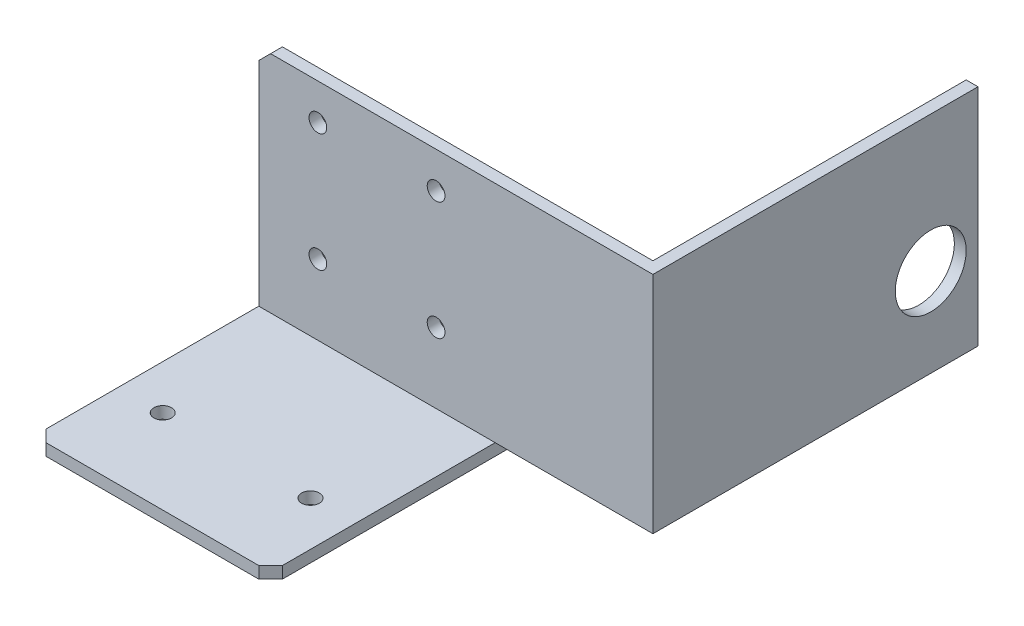
ISO-10303-21;
HEADER;
FILE_DESCRIPTION(('STEP AP214'),'2;1');
FILE_NAME('part.step','',(''),(''),'','','');
FILE_SCHEMA(('AUTOMOTIVE_DESIGN { 1 0 10303 214 1 1 1 1 }'));
ENDSEC;
DATA;
#1=APPLICATION_CONTEXT('core data for automotive mechanical design processes');
#2=APPLICATION_PROTOCOL_DEFINITION('international standard','automotive_design',2000,#1);
#3=PRODUCT_CONTEXT('',#1,'mechanical');
#4=PRODUCT('Part','Part','',(#3));
#5=PRODUCT_RELATED_PRODUCT_CATEGORY('part','',(#4));
#6=PRODUCT_DEFINITION_FORMATION('','',#4);
#7=PRODUCT_DEFINITION_CONTEXT('part definition',#1,'design');
#8=PRODUCT_DEFINITION('design','',#6,#7);
#9=PRODUCT_DEFINITION_SHAPE('','',#8);
#10=(LENGTH_UNIT() NAMED_UNIT(*) SI_UNIT(.MILLI.,.METRE.));
#11=(NAMED_UNIT(*) PLANE_ANGLE_UNIT() SI_UNIT($,.RADIAN.));
#12=(NAMED_UNIT(*) SI_UNIT($,.STERADIAN.) SOLID_ANGLE_UNIT());
#13=UNCERTAINTY_MEASURE_WITH_UNIT(LENGTH_MEASURE(1.E-05),#10,'distance_accuracy_value','');
#14=(GEOMETRIC_REPRESENTATION_CONTEXT(3) GLOBAL_UNCERTAINTY_ASSIGNED_CONTEXT((#13)) GLOBAL_UNIT_ASSIGNED_CONTEXT((#10,
#11,#12)) REPRESENTATION_CONTEXT('',''));
#15=CARTESIAN_POINT('',(0.,0.,0.));
#16=DIRECTION('',(0.,0.,1.));
#17=DIRECTION('',(1.,0.,0.));
#18=AXIS2_PLACEMENT_3D('',#15,#16,#17);
#19=CARTESIAN_POINT('',(40.,0.,38.));
#20=DIRECTION('',(0.,-1.,0.));
#21=DIRECTION('',(0.,0.,-1.));
#22=AXIS2_PLACEMENT_3D('',#19,#20,#21);
#23=PLANE('',#22);
#24=CARTESIAN_POINT('',(7.5,0.,23.75));
#25=DIRECTION('',(0.,-1.,0.));
#26=DIRECTION('',(0.,0.,-1.));
#27=AXIS2_PLACEMENT_3D('',#24,#25,#26);
#28=CIRCLE('',#27,1.49999999997635);
#29=CARTESIAN_POINT('',(7.5,0.,22.2500000000236));
#30=VERTEX_POINT('',#29);
#31=EDGE_CURVE('E198',#30,#30,#28,.F.);
#32=ORIENTED_EDGE('',*,*,#31,.F.);
#33=EDGE_LOOP('',(#32));
#34=FACE_BOUND('',#33,.T.);
#35=CARTESIAN_POINT('',(32.5,0.,23.75));
#36=DIRECTION('',(0.,-1.,0.));
#37=DIRECTION('',(0.,0.,-1.));
#38=AXIS2_PLACEMENT_3D('',#35,#36,#37);
#39=CIRCLE('',#38,1.49999999997635);
#40=CARTESIAN_POINT('',(32.5,0.,22.2500000000236));
#41=VERTEX_POINT('',#40);
#42=EDGE_CURVE('E204',#41,#41,#39,.F.);
#43=ORIENTED_EDGE('',*,*,#42,.F.);
#44=EDGE_LOOP('',(#43));
#45=FACE_BOUND('',#44,.T.);
#46=DIRECTION('',(-1.,0.,0.));
#47=VECTOR('',#46,1.);
#48=CARTESIAN_POINT('',(40.,0.,38.));
#49=LINE('',#48,#47);
#50=CARTESIAN_POINT('',(38.,0.,38.));
#51=VERTEX_POINT('',#50);
#52=CARTESIAN_POINT('',(2.00000000000001,0.,38.));
#53=VERTEX_POINT('',#52);
#54=EDGE_CURVE('E237',#51,#53,#49,.T.);
#55=ORIENTED_EDGE('',*,*,#54,.F.);
#56=DIRECTION('',(0.70710678118655,0.,-0.707106781186545));
#57=VECTOR('',#56,1.);
#58=CARTESIAN_POINT('',(40.,0.,36.));
#59=LINE('',#58,#57);
#60=CARTESIAN_POINT('',(40.,0.,36.));
#61=VERTEX_POINT('',#60);
#62=EDGE_CURVE('E254',#51,#61,#59,.T.);
#63=ORIENTED_EDGE('',*,*,#62,.T.);
#64=DIRECTION('',(0.,0.,1.));
#65=VECTOR('',#64,1.);
#66=CARTESIAN_POINT('',(40.,0.,38.));
#67=LINE('',#66,#65);
#68=CARTESIAN_POINT('',(40.,0.,0.));
#69=VERTEX_POINT('',#68);
#70=EDGE_CURVE('E208',#69,#61,#67,.T.);
#71=ORIENTED_EDGE('',*,*,#70,.F.);
#72=DIRECTION('',(-1.,0.,0.));
#73=VECTOR('',#72,1.);
#74=CARTESIAN_POINT('',(40.,0.,0.));
#75=LINE('',#74,#73);
#76=CARTESIAN_POINT('',(0.,0.,0.));
#77=VERTEX_POINT('',#76);
#78=EDGE_CURVE('E217',#69,#77,#75,.T.);
#79=ORIENTED_EDGE('',*,*,#78,.T.);
#80=DIRECTION('',(0.,0.,1.));
#81=VECTOR('',#80,1.);
#82=CARTESIAN_POINT('',(0.,0.,38.));
#83=LINE('',#82,#81);
#84=CARTESIAN_POINT('',(0.,0.,36.));
#85=VERTEX_POINT('',#84);
#86=EDGE_CURVE('E207',#77,#85,#83,.T.);
#87=ORIENTED_EDGE('',*,*,#86,.T.);
#88=DIRECTION('',(-0.707106781186545,0.,-0.70710678118655));
#89=VECTOR('',#88,1.);
#90=CARTESIAN_POINT('',(1.99999999999999,0.,38.));
#91=LINE('',#90,#89);
#92=EDGE_CURVE('E252',#85,#53,#91,.F.);
#93=ORIENTED_EDGE('',*,*,#92,.T.);
#94=EDGE_LOOP('',(#55,#63,#71,#79,#87,#93));
#95=FACE_BOUND('',#94,.T.);
#96=ADVANCED_FACE('F38',(#34,#45,#95),#23,.F.);
#97=CARTESIAN_POINT('',(40.,-2.,38.));
#98=DIRECTION('',(0.,0.,-1.));
#99=DIRECTION('',(-1.,0.,0.));
#100=AXIS2_PLACEMENT_3D('',#97,#98,#99);
#101=PLANE('',#100);
#102=DIRECTION('',(-1.,0.,0.));
#103=VECTOR('',#102,1.);
#104=CARTESIAN_POINT('',(40.,-2.,38.));
#105=LINE('',#104,#103);
#106=CARTESIAN_POINT('',(38.,-2.,38.));
#107=VERTEX_POINT('',#106);
#108=CARTESIAN_POINT('',(2.00000000000001,-2.,38.));
#109=VERTEX_POINT('',#108);
#110=EDGE_CURVE('E234',#107,#109,#105,.T.);
#111=ORIENTED_EDGE('',*,*,#110,.F.);
#112=DIRECTION('',(0.,1.,0.));
#113=VECTOR('',#112,1.);
#114=CARTESIAN_POINT('',(38.,0.,38.));
#115=LINE('',#114,#113);
#116=EDGE_CURVE('E250',#107,#51,#115,.T.);
#117=ORIENTED_EDGE('',*,*,#116,.T.);
#118=ORIENTED_EDGE('',*,*,#54,.T.);
#119=DIRECTION('',(0.,-1.,0.));
#120=VECTOR('',#119,1.);
#121=CARTESIAN_POINT('',(1.99999999999999,-2.,38.));
#122=LINE('',#121,#120);
#123=EDGE_CURVE('E247',#53,#109,#122,.T.);
#124=ORIENTED_EDGE('',*,*,#123,.T.);
#125=EDGE_LOOP('',(#111,#117,#118,#124));
#126=FACE_BOUND('',#125,.T.);
#127=ADVANCED_FACE('F304',(#126),#101,.F.);
#128=CARTESIAN_POINT('',(40.,-2.,-2.00000000000001));
#129=DIRECTION('',(0.,1.,0.));
#130=DIRECTION('',(0.,0.,1.));
#131=AXIS2_PLACEMENT_3D('',#128,#129,#130);
#132=PLANE('',#131);
#133=CARTESIAN_POINT('',(7.5,-2.,23.75));
#134=DIRECTION('',(0.,-1.,0.));
#135=DIRECTION('',(0.,0.,-1.));
#136=AXIS2_PLACEMENT_3D('',#133,#134,#135);
#137=CIRCLE('',#136,1.49999999997635);
#138=CARTESIAN_POINT('',(7.5,-2.,22.2500000000236));
#139=VERTEX_POINT('',#138);
#140=EDGE_CURVE('E195',#139,#139,#137,.T.);
#141=ORIENTED_EDGE('',*,*,#140,.F.);
#142=EDGE_LOOP('',(#141));
#143=FACE_BOUND('',#142,.T.);
#144=CARTESIAN_POINT('',(32.5,-2.,23.75));
#145=DIRECTION('',(0.,-1.,0.));
#146=DIRECTION('',(0.,0.,-1.));
#147=AXIS2_PLACEMENT_3D('',#144,#145,#146);
#148=CIRCLE('',#147,1.49999999997635);
#149=CARTESIAN_POINT('',(32.5,-2.,22.2500000000236));
#150=VERTEX_POINT('',#149);
#151=EDGE_CURVE('E201',#150,#150,#148,.T.);
#152=ORIENTED_EDGE('',*,*,#151,.F.);
#153=EDGE_LOOP('',(#152));
#154=FACE_BOUND('',#153,.T.);
#155=DIRECTION('',(0.,0.,-1.));
#156=VECTOR('',#155,1.);
#157=CARTESIAN_POINT('',(40.,-2.,-2.00000000000001));
#158=LINE('',#157,#156);
#159=CARTESIAN_POINT('',(40.,-2.,36.));
#160=VERTEX_POINT('',#159);
#161=CARTESIAN_POINT('',(40.,-2.,-2.00000000000001));
#162=VERTEX_POINT('',#161);
#163=EDGE_CURVE('E211',#160,#162,#158,.T.);
#164=ORIENTED_EDGE('',*,*,#163,.F.);
#165=DIRECTION('',(-0.70710678118655,0.,0.707106781186545));
#166=VECTOR('',#165,1.);
#167=CARTESIAN_POINT('',(40.,-2.,36.));
#168=LINE('',#167,#166);
#169=EDGE_CURVE('E245',#160,#107,#168,.T.);
#170=ORIENTED_EDGE('',*,*,#169,.T.);
#171=ORIENTED_EDGE('',*,*,#110,.T.);
#172=DIRECTION('',(0.707106781186545,0.,0.70710678118655));
#173=VECTOR('',#172,1.);
#174=CARTESIAN_POINT('',(1.99999999999999,-2.,38.));
#175=LINE('',#174,#173);
#176=CARTESIAN_POINT('',(0.,-2.,36.));
#177=VERTEX_POINT('',#176);
#178=EDGE_CURVE('E243',#109,#177,#175,.F.);
#179=ORIENTED_EDGE('',*,*,#178,.T.);
#180=DIRECTION('',(0.,0.,-1.));
#181=VECTOR('',#180,1.);
#182=CARTESIAN_POINT('',(0.,-2.,-2.00000000000001));
#183=LINE('',#182,#181);
#184=CARTESIAN_POINT('',(0.,-2.,-2.00000000000001));
#185=VERTEX_POINT('',#184);
#186=EDGE_CURVE('E220',#177,#185,#183,.T.);
#187=ORIENTED_EDGE('',*,*,#186,.T.);
#188=DIRECTION('',(-1.,0.,0.));
#189=VECTOR('',#188,1.);
#190=CARTESIAN_POINT('',(40.,-2.,-2.00000000000001));
#191=LINE('',#190,#189);
#192=EDGE_CURVE('E231',#162,#185,#191,.T.);
#193=ORIENTED_EDGE('',*,*,#192,.F.);
#194=EDGE_LOOP('',(#164,#170,#171,#179,#187,#193));
#195=FACE_BOUND('',#194,.T.);
#196=ADVANCED_FACE('F306',(#143,#154,#195),#132,.F.);
#197=CARTESIAN_POINT('',(40.,38.,-2.));
#198=DIRECTION('',(0.,0.,1.));
#199=DIRECTION('',(0.,-1.,0.));
#200=AXIS2_PLACEMENT_3D('',#197,#198,#199);
#201=PLANE('',#200);
#202=DIRECTION('',(-1.,0.,0.));
#203=VECTOR('',#202,1.);
#204=CARTESIAN_POINT('',(40.,38.,-2.));
#205=LINE('',#204,#203);
#206=CARTESIAN_POINT('',(64.69,38.,-2.00000000000001));
#207=VERTEX_POINT('',#206);
#208=CARTESIAN_POINT('',(2.00000000000001,38.,-2.));
#209=VERTEX_POINT('',#208);
#210=EDGE_CURVE('E62',#207,#209,#205,.T.);
#211=ORIENTED_EDGE('',*,*,#210,.F.);
#212=DIRECTION('',(0.,-1.,0.));
#213=VECTOR('',#212,1.);
#214=CARTESIAN_POINT('',(64.69,38.,-2.00000000000001));
#215=LINE('',#214,#213);
#216=CARTESIAN_POINT('',(64.69,0.,-2.00000000000001));
#217=VERTEX_POINT('',#216);
#218=EDGE_CURVE('E152',#207,#217,#215,.T.);
#219=ORIENTED_EDGE('',*,*,#218,.T.);
#220=DIRECTION('',(1.,0.,0.));
#221=VECTOR('',#220,1.);
#222=CARTESIAN_POINT('',(37.,0.,-2.00000000000001));
#223=LINE('',#222,#221);
#224=CARTESIAN_POINT('',(40.,0.,-2.00000000000001));
#225=VERTEX_POINT('',#224);
#226=EDGE_CURVE('E151',#225,#217,#223,.T.);
#227=ORIENTED_EDGE('',*,*,#226,.F.);
#228=DIRECTION('',(0.,1.,0.));
#229=VECTOR('',#228,1.);
#230=CARTESIAN_POINT('',(40.,38.,-2.));
#231=LINE('',#230,#229);
#232=EDGE_CURVE('E214',#162,#225,#231,.T.);
#233=ORIENTED_EDGE('',*,*,#232,.F.);
#234=ORIENTED_EDGE('',*,*,#192,.T.);
#235=DIRECTION('',(0.,1.,0.));
#236=VECTOR('',#235,1.);
#237=CARTESIAN_POINT('',(0.,38.,-2.));
#238=LINE('',#237,#236);
#239=CARTESIAN_POINT('',(0.,36.,-2.));
#240=VERTEX_POINT('',#239);
#241=EDGE_CURVE('E222',#185,#240,#238,.T.);
#242=ORIENTED_EDGE('',*,*,#241,.T.);
#243=DIRECTION('',(-0.707106781186545,-0.70710678118655,0.));
#244=VECTOR('',#243,1.);
#245=CARTESIAN_POINT('',(1.99999999999999,38.,-2.));
#246=LINE('',#245,#244);
#247=EDGE_CURVE('E47',#240,#209,#246,.F.);
#248=ORIENTED_EDGE('',*,*,#247,.T.);
#249=EDGE_LOOP('',(#211,#219,#227,#233,#234,#242,#248));
#250=FACE_BOUND('',#249,.T.);
#251=CARTESIAN_POINT('',(9.99999999999981,11.9,-2.));
#252=DIRECTION('',(0.,0.,-1.));
#253=DIRECTION('',(0.,1.,0.));
#254=AXIS2_PLACEMENT_3D('',#251,#252,#253);
#255=CIRCLE('',#254,1.5);
#256=CARTESIAN_POINT('',(9.99999999999981,13.4,-2.));
#257=VERTEX_POINT('',#256);
#258=EDGE_CURVE('E170',#257,#257,#255,.T.);
#259=ORIENTED_EDGE('',*,*,#258,.F.);
#260=EDGE_LOOP('',(#259));
#261=FACE_BOUND('',#260,.T.);
#262=CARTESIAN_POINT('',(29.9999999999998,11.8999999999999,-2.));
#263=DIRECTION('',(0.,0.,-1.));
#264=DIRECTION('',(0.,1.,0.));
#265=AXIS2_PLACEMENT_3D('',#262,#263,#264);
#266=CIRCLE('',#265,1.5);
#267=CARTESIAN_POINT('',(29.9999999999998,13.3999999999999,-2.));
#268=VERTEX_POINT('',#267);
#269=EDGE_CURVE('E177',#268,#268,#266,.T.);
#270=ORIENTED_EDGE('',*,*,#269,.F.);
#271=EDGE_LOOP('',(#270));
#272=FACE_BOUND('',#271,.T.);
#273=CARTESIAN_POINT('',(30.,31.8999999999999,-2.));
#274=DIRECTION('',(0.,0.,-1.));
#275=DIRECTION('',(0.,1.,0.));
#276=AXIS2_PLACEMENT_3D('',#273,#274,#275);
#277=CIRCLE('',#276,1.5);
#278=CARTESIAN_POINT('',(30.,33.3999999999999,-2.));
#279=VERTEX_POINT('',#278);
#280=EDGE_CURVE('E183',#279,#279,#277,.T.);
#281=ORIENTED_EDGE('',*,*,#280,.F.);
#282=EDGE_LOOP('',(#281));
#283=FACE_BOUND('',#282,.T.);
#284=CARTESIAN_POINT('',(10.,31.9,-2.));
#285=DIRECTION('',(0.,0.,-1.));
#286=DIRECTION('',(0.,1.,0.));
#287=AXIS2_PLACEMENT_3D('',#284,#285,#286);
#288=CIRCLE('',#287,1.5);
#289=CARTESIAN_POINT('',(10.,33.4,-2.));
#290=VERTEX_POINT('',#289);
#291=EDGE_CURVE('E189',#290,#290,#288,.T.);
#292=ORIENTED_EDGE('',*,*,#291,.F.);
#293=EDGE_LOOP('',(#292));
#294=FACE_BOUND('',#293,.T.);
#295=ADVANCED_FACE('F267',(#250,#261,#272,#283,#294),#201,.F.);
#296=CARTESIAN_POINT('',(40.,38.,0.));
#297=DIRECTION('',(0.,-1.,0.));
#298=DIRECTION('',(0.,0.,-1.));
#299=AXIS2_PLACEMENT_3D('',#296,#297,#298);
#300=PLANE('',#299);
#301=DIRECTION('',(0.,0.,1.));
#302=VECTOR('',#301,1.);
#303=CARTESIAN_POINT('',(66.69,38.,0.));
#304=LINE('',#303,#302);
#305=CARTESIAN_POINT('',(66.69,38.,-55.));
#306=VERTEX_POINT('',#305);
#307=CARTESIAN_POINT('',(66.69,38.,0.));
#308=VERTEX_POINT('',#307);
#309=EDGE_CURVE('E165',#306,#308,#304,.T.);
#310=ORIENTED_EDGE('',*,*,#309,.F.);
#311=DIRECTION('',(1.,0.,0.));
#312=VECTOR('',#311,1.);
#313=CARTESIAN_POINT('',(64.69,38.,-55.));
#314=LINE('',#313,#312);
#315=CARTESIAN_POINT('',(64.69,38.,-55.));
#316=VERTEX_POINT('',#315);
#317=EDGE_CURVE('E143',#316,#306,#314,.T.);
#318=ORIENTED_EDGE('',*,*,#317,.F.);
#319=DIRECTION('',(0.,0.,1.));
#320=VECTOR('',#319,1.);
#321=CARTESIAN_POINT('',(64.69,38.,-2.00000000000001));
#322=LINE('',#321,#320);
#323=EDGE_CURVE('E144',#316,#207,#322,.T.);
#324=ORIENTED_EDGE('',*,*,#323,.T.);
#325=ORIENTED_EDGE('',*,*,#210,.T.);
#326=DIRECTION('',(0.,0.,1.));
#327=VECTOR('',#326,1.);
#328=CARTESIAN_POINT('',(1.99999999999999,38.,0.));
#329=LINE('',#328,#327);
#330=CARTESIAN_POINT('',(2.00000000000001,38.,0.));
#331=VERTEX_POINT('',#330);
#332=EDGE_CURVE('E260',#209,#331,#329,.T.);
#333=ORIENTED_EDGE('',*,*,#332,.T.);
#334=DIRECTION('',(-1.,0.,0.));
#335=VECTOR('',#334,1.);
#336=CARTESIAN_POINT('',(40.,38.,0.));
#337=LINE('',#336,#335);
#338=EDGE_CURVE('E228',#308,#331,#337,.T.);
#339=ORIENTED_EDGE('',*,*,#338,.F.);
#340=EDGE_LOOP('',(#310,#318,#324,#325,#333,#339));
#341=FACE_BOUND('',#340,.T.);
#342=ADVANCED_FACE('F273',(#341),#300,.F.);
#343=CARTESIAN_POINT('',(40.,0.,0.));
#344=DIRECTION('',(0.,0.,-1.));
#345=DIRECTION('',(-1.,0.,0.));
#346=AXIS2_PLACEMENT_3D('',#343,#344,#345);
#347=PLANE('',#346);
#348=ORIENTED_EDGE('',*,*,#78,.F.);
#349=DIRECTION('',(1.,0.,0.));
#350=VECTOR('',#349,1.);
#351=CARTESIAN_POINT('',(37.,0.,0.));
#352=LINE('',#351,#350);
#353=CARTESIAN_POINT('',(66.69,0.,0.));
#354=VERTEX_POINT('',#353);
#355=EDGE_CURVE('E168',#69,#354,#352,.T.);
#356=ORIENTED_EDGE('',*,*,#355,.T.);
#357=DIRECTION('',(0.,-1.,0.));
#358=VECTOR('',#357,1.);
#359=CARTESIAN_POINT('',(66.69,38.,0.));
#360=LINE('',#359,#358);
#361=EDGE_CURVE('E159',#308,#354,#360,.T.);
#362=ORIENTED_EDGE('',*,*,#361,.F.);
#363=ORIENTED_EDGE('',*,*,#338,.T.);
#364=DIRECTION('',(0.707106781186545,0.70710678118655,0.));
#365=VECTOR('',#364,1.);
#366=CARTESIAN_POINT('',(1.99999999999999,38.,0.));
#367=LINE('',#366,#365);
#368=CARTESIAN_POINT('',(0.,36.,0.));
#369=VERTEX_POINT('',#368);
#370=EDGE_CURVE('E262',#331,#369,#367,.F.);
#371=ORIENTED_EDGE('',*,*,#370,.T.);
#372=DIRECTION('',(0.,-1.,0.));
#373=VECTOR('',#372,1.);
#374=CARTESIAN_POINT('',(0.,0.,0.));
#375=LINE('',#374,#373);
#376=EDGE_CURVE('E212',#369,#77,#375,.T.);
#377=ORIENTED_EDGE('',*,*,#376,.T.);
#378=EDGE_LOOP('',(#348,#356,#362,#363,#371,#377));
#379=FACE_BOUND('',#378,.T.);
#380=CARTESIAN_POINT('',(10.,31.9,0.));
#381=DIRECTION('',(0.,0.,-1.));
#382=DIRECTION('',(-1.,0.,0.));
#383=AXIS2_PLACEMENT_3D('',#380,#381,#382);
#384=CIRCLE('',#383,1.5);
#385=CARTESIAN_POINT('',(8.50000000000001,31.9,0.));
#386=VERTEX_POINT('',#385);
#387=EDGE_CURVE('E192',#386,#386,#384,.F.);
#388=ORIENTED_EDGE('',*,*,#387,.F.);
#389=EDGE_LOOP('',(#388));
#390=FACE_BOUND('',#389,.T.);
#391=CARTESIAN_POINT('',(30.,31.8999999999999,0.));
#392=DIRECTION('',(0.,0.,-1.));
#393=DIRECTION('',(-1.,0.,0.));
#394=AXIS2_PLACEMENT_3D('',#391,#392,#393);
#395=CIRCLE('',#394,1.5);
#396=CARTESIAN_POINT('',(28.5,31.8999999999999,0.));
#397=VERTEX_POINT('',#396);
#398=EDGE_CURVE('E186',#397,#397,#395,.F.);
#399=ORIENTED_EDGE('',*,*,#398,.F.);
#400=EDGE_LOOP('',(#399));
#401=FACE_BOUND('',#400,.T.);
#402=CARTESIAN_POINT('',(29.9999999999998,11.8999999999999,0.));
#403=DIRECTION('',(0.,0.,-1.));
#404=DIRECTION('',(-1.,0.,0.));
#405=AXIS2_PLACEMENT_3D('',#402,#403,#404);
#406=CIRCLE('',#405,1.5);
#407=CARTESIAN_POINT('',(28.4999999999998,11.8999999999999,0.));
#408=VERTEX_POINT('',#407);
#409=EDGE_CURVE('E180',#408,#408,#406,.F.);
#410=ORIENTED_EDGE('',*,*,#409,.F.);
#411=EDGE_LOOP('',(#410));
#412=FACE_BOUND('',#411,.T.);
#413=CARTESIAN_POINT('',(9.99999999999981,11.9,0.));
#414=DIRECTION('',(0.,0.,-1.));
#415=DIRECTION('',(-1.,0.,0.));
#416=AXIS2_PLACEMENT_3D('',#413,#414,#415);
#417=CIRCLE('',#416,1.5);
#418=CARTESIAN_POINT('',(8.4999999999998,11.9,0.));
#419=VERTEX_POINT('',#418);
#420=EDGE_CURVE('E174',#419,#419,#417,.F.);
#421=ORIENTED_EDGE('',*,*,#420,.F.);
#422=EDGE_LOOP('',(#421));
#423=FACE_BOUND('',#422,.T.);
#424=ADVANCED_FACE('F279',(#379,#390,#401,#412,#423),#347,.F.);
#425=CARTESIAN_POINT('',(40.,0.,0.));
#426=DIRECTION('',(1.,0.,0.));
#427=DIRECTION('',(0.,0.,-1.));
#428=AXIS2_PLACEMENT_3D('',#425,#426,#427);
#429=PLANE('',#428);
#430=DIRECTION('',(0.,0.,-1.));
#431=VECTOR('',#430,1.);
#432=CARTESIAN_POINT('',(40.,0.,0.));
#433=LINE('',#432,#431);
#434=EDGE_CURVE('E11',#69,#225,#433,.T.);
#435=ORIENTED_EDGE('',*,*,#434,.F.);
#436=ORIENTED_EDGE('',*,*,#70,.T.);
#437=DIRECTION('',(0.,-1.,0.));
#438=VECTOR('',#437,1.);
#439=CARTESIAN_POINT('',(40.,-2.,36.));
#440=LINE('',#439,#438);
#441=EDGE_CURVE('E240',#61,#160,#440,.T.);
#442=ORIENTED_EDGE('',*,*,#441,.T.);
#443=ORIENTED_EDGE('',*,*,#163,.T.);
#444=ORIENTED_EDGE('',*,*,#232,.T.);
#445=EDGE_LOOP('',(#435,#436,#442,#443,#444));
#446=FACE_BOUND('',#445,.T.);
#447=ADVANCED_FACE('F284',(#446),#429,.T.);
#448=CARTESIAN_POINT('',(0.,0.,0.));
#449=DIRECTION('',(1.,0.,0.));
#450=DIRECTION('',(0.,0.,-1.));
#451=AXIS2_PLACEMENT_3D('',#448,#449,#450);
#452=PLANE('',#451);
#453=ORIENTED_EDGE('',*,*,#186,.F.);
#454=DIRECTION('',(0.,1.,0.));
#455=VECTOR('',#454,1.);
#456=CARTESIAN_POINT('',(0.,0.,36.));
#457=LINE('',#456,#455);
#458=EDGE_CURVE('E258',#177,#85,#457,.T.);
#459=ORIENTED_EDGE('',*,*,#458,.T.);
#460=ORIENTED_EDGE('',*,*,#86,.F.);
#461=ORIENTED_EDGE('',*,*,#376,.F.);
#462=DIRECTION('',(0.,0.,-1.));
#463=VECTOR('',#462,1.);
#464=CARTESIAN_POINT('',(0.,36.,0.));
#465=LINE('',#464,#463);
#466=EDGE_CURVE('E256',#369,#240,#465,.T.);
#467=ORIENTED_EDGE('',*,*,#466,.T.);
#468=ORIENTED_EDGE('',*,*,#241,.F.);
#469=EDGE_LOOP('',(#453,#459,#460,#461,#467,#468));
#470=FACE_BOUND('',#469,.T.);
#471=ADVANCED_FACE('F292',(#470),#452,.F.);
#472=CARTESIAN_POINT('',(32.5,38.001,23.75));
#473=DIRECTION('',(0.,-1.,0.));
#474=DIRECTION('',(0.,0.,-1.));
#475=AXIS2_PLACEMENT_3D('',#472,#473,#474);
#476=CYLINDRICAL_SURFACE('',#475,1.49999999997635);
#477=ORIENTED_EDGE('',*,*,#151,.T.);
#478=EDGE_LOOP('',(#477));
#479=FACE_BOUND('',#478,.T.);
#480=ORIENTED_EDGE('',*,*,#42,.T.);
#481=EDGE_LOOP('',(#480));
#482=FACE_BOUND('',#481,.T.);
#483=ADVANCED_FACE('F341',(#479,#482),#476,.F.);
#484=CARTESIAN_POINT('',(7.5,38.001,23.75));
#485=DIRECTION('',(0.,-1.,0.));
#486=DIRECTION('',(0.,0.,-1.));
#487=AXIS2_PLACEMENT_3D('',#484,#485,#486);
#488=CYLINDRICAL_SURFACE('',#487,1.49999999997635);
#489=ORIENTED_EDGE('',*,*,#140,.T.);
#490=EDGE_LOOP('',(#489));
#491=FACE_BOUND('',#490,.T.);
#492=ORIENTED_EDGE('',*,*,#31,.T.);
#493=EDGE_LOOP('',(#492));
#494=FACE_BOUND('',#493,.T.);
#495=ADVANCED_FACE('F346',(#491,#494),#488,.F.);
#496=CARTESIAN_POINT('',(10.,31.9,38.001));
#497=DIRECTION('',(0.,0.,-1.));
#498=DIRECTION('',(0.,1.,0.));
#499=AXIS2_PLACEMENT_3D('',#496,#497,#498);
#500=CYLINDRICAL_SURFACE('',#499,1.5);
#501=ORIENTED_EDGE('',*,*,#291,.T.);
#502=EDGE_LOOP('',(#501));
#503=FACE_BOUND('',#502,.T.);
#504=ORIENTED_EDGE('',*,*,#387,.T.);
#505=EDGE_LOOP('',(#504));
#506=FACE_BOUND('',#505,.T.);
#507=ADVANCED_FACE('F350',(#503,#506),#500,.F.);
#508=CARTESIAN_POINT('',(30.,31.8999999999999,38.001));
#509=DIRECTION('',(0.,0.,-1.));
#510=DIRECTION('',(0.,1.,0.));
#511=AXIS2_PLACEMENT_3D('',#508,#509,#510);
#512=CYLINDRICAL_SURFACE('',#511,1.5);
#513=ORIENTED_EDGE('',*,*,#280,.T.);
#514=EDGE_LOOP('',(#513));
#515=FACE_BOUND('',#514,.T.);
#516=ORIENTED_EDGE('',*,*,#398,.T.);
#517=EDGE_LOOP('',(#516));
#518=FACE_BOUND('',#517,.T.);
#519=ADVANCED_FACE('F354',(#515,#518),#512,.F.);
#520=CARTESIAN_POINT('',(29.9999999999998,11.8999999999999,38.001));
#521=DIRECTION('',(0.,0.,-1.));
#522=DIRECTION('',(0.,1.,0.));
#523=AXIS2_PLACEMENT_3D('',#520,#521,#522);
#524=CYLINDRICAL_SURFACE('',#523,1.5);
#525=ORIENTED_EDGE('',*,*,#269,.T.);
#526=EDGE_LOOP('',(#525));
#527=FACE_BOUND('',#526,.T.);
#528=ORIENTED_EDGE('',*,*,#409,.T.);
#529=EDGE_LOOP('',(#528));
#530=FACE_BOUND('',#529,.T.);
#531=ADVANCED_FACE('F317',(#527,#530),#524,.F.);
#532=CARTESIAN_POINT('',(9.99999999999981,11.9,38.001));
#533=DIRECTION('',(0.,0.,-1.));
#534=DIRECTION('',(0.,1.,0.));
#535=AXIS2_PLACEMENT_3D('',#532,#533,#534);
#536=CYLINDRICAL_SURFACE('',#535,1.5);
#537=ORIENTED_EDGE('',*,*,#258,.T.);
#538=EDGE_LOOP('',(#537));
#539=FACE_BOUND('',#538,.T.);
#540=ORIENTED_EDGE('',*,*,#420,.T.);
#541=EDGE_LOOP('',(#540));
#542=FACE_BOUND('',#541,.T.);
#543=ADVANCED_FACE('F311',(#539,#542),#536,.F.);
#544=CARTESIAN_POINT('',(40.,0.,36.));
#545=DIRECTION('',(0.707106781186545,0.,0.70710678118655));
#546=DIRECTION('',(0.,1.,0.));
#547=AXIS2_PLACEMENT_3D('',#544,#545,#546);
#548=PLANE('',#547);
#549=ORIENTED_EDGE('',*,*,#62,.F.);
#550=ORIENTED_EDGE('',*,*,#116,.F.);
#551=ORIENTED_EDGE('',*,*,#169,.F.);
#552=ORIENTED_EDGE('',*,*,#441,.F.);
#553=EDGE_LOOP('',(#549,#550,#551,#552));
#554=FACE_BOUND('',#553,.T.);
#555=ADVANCED_FACE('F309',(#554),#548,.T.);
#556=CARTESIAN_POINT('',(1.99999999999999,-2.,38.));
#557=DIRECTION('',(0.70710678118655,0.,-0.707106781186545));
#558=DIRECTION('',(0.,-1.,0.));
#559=AXIS2_PLACEMENT_3D('',#556,#557,#558);
#560=PLANE('',#559);
#561=ORIENTED_EDGE('',*,*,#92,.F.);
#562=ORIENTED_EDGE('',*,*,#458,.F.);
#563=ORIENTED_EDGE('',*,*,#178,.F.);
#564=ORIENTED_EDGE('',*,*,#123,.F.);
#565=EDGE_LOOP('',(#561,#562,#563,#564));
#566=FACE_BOUND('',#565,.T.);
#567=ADVANCED_FACE('F301',(#566),#560,.F.);
#568=CARTESIAN_POINT('',(1.99999999999999,38.,0.));
#569=DIRECTION('',(0.70710678118655,-0.707106781186545,0.));
#570=DIRECTION('',(0.,0.,1.));
#571=AXIS2_PLACEMENT_3D('',#568,#569,#570);
#572=PLANE('',#571);
#573=ORIENTED_EDGE('',*,*,#247,.F.);
#574=ORIENTED_EDGE('',*,*,#466,.F.);
#575=ORIENTED_EDGE('',*,*,#370,.F.);
#576=ORIENTED_EDGE('',*,*,#332,.F.);
#577=EDGE_LOOP('',(#573,#574,#575,#576));
#578=FACE_BOUND('',#577,.T.);
#579=ADVANCED_FACE('F40',(#578),#572,.F.);
#580=CARTESIAN_POINT('',(37.,0.,0.));
#581=DIRECTION('',(0.,-1.,0.));
#582=DIRECTION('',(0.,0.,-1.));
#583=AXIS2_PLACEMENT_3D('',#580,#581,#582);
#584=PLANE('',#583);
#585=ORIENTED_EDGE('',*,*,#355,.F.);
#586=ORIENTED_EDGE('',*,*,#434,.T.);
#587=ORIENTED_EDGE('',*,*,#226,.T.);
#588=DIRECTION('',(0.,0.,-1.));
#589=VECTOR('',#588,1.);
#590=CARTESIAN_POINT('',(64.69,0.,-2.00000000000001));
#591=LINE('',#590,#589);
#592=CARTESIAN_POINT('',(64.69,0.,-55.));
#593=VERTEX_POINT('',#592);
#594=EDGE_CURVE('E54',#217,#593,#591,.T.);
#595=ORIENTED_EDGE('',*,*,#594,.T.);
#596=DIRECTION('',(1.,0.,0.));
#597=VECTOR('',#596,1.);
#598=CARTESIAN_POINT('',(64.69,0.,-55.));
#599=LINE('',#598,#597);
#600=CARTESIAN_POINT('',(66.69,0.,-55.));
#601=VERTEX_POINT('',#600);
#602=EDGE_CURVE('E134',#593,#601,#599,.T.);
#603=ORIENTED_EDGE('',*,*,#602,.T.);
#604=DIRECTION('',(0.,0.,-1.));
#605=VECTOR('',#604,1.);
#606=CARTESIAN_POINT('',(66.69,0.,0.));
#607=LINE('',#606,#605);
#608=EDGE_CURVE('E163',#354,#601,#607,.T.);
#609=ORIENTED_EDGE('',*,*,#608,.F.);
#610=EDGE_LOOP('',(#585,#586,#587,#595,#603,#609));
#611=FACE_BOUND('',#610,.T.);
#612=ADVANCED_FACE('F149',(#611),#584,.T.);
#613=CARTESIAN_POINT('',(66.69,0.,0.));
#614=DIRECTION('',(1.,0.,0.));
#615=DIRECTION('',(0.,0.,-1.));
#616=AXIS2_PLACEMENT_3D('',#613,#614,#615);
#617=PLANE('',#616);
#618=CARTESIAN_POINT('',(66.69,15.,-47.));
#619=DIRECTION('',(1.,0.,0.));
#620=DIRECTION('',(0.,0.,-1.));
#621=AXIS2_PLACEMENT_3D('',#618,#619,#620);
#622=CIRCLE('',#621,6.);
#623=CARTESIAN_POINT('',(66.69,15.,-53.));
#624=VERTEX_POINT('',#623);
#625=EDGE_CURVE('E380',#624,#624,#622,.T.);
#626=ORIENTED_EDGE('',*,*,#625,.F.);
#627=EDGE_LOOP('',(#626));
#628=FACE_BOUND('',#627,.T.);
#629=ORIENTED_EDGE('',*,*,#361,.T.);
#630=ORIENTED_EDGE('',*,*,#608,.T.);
#631=DIRECTION('',(0.,1.,0.));
#632=VECTOR('',#631,1.);
#633=CARTESIAN_POINT('',(66.69,38.,-55.));
#634=LINE('',#633,#632);
#635=EDGE_CURVE('E140',#601,#306,#634,.T.);
#636=ORIENTED_EDGE('',*,*,#635,.T.);
#637=ORIENTED_EDGE('',*,*,#309,.T.);
#638=EDGE_LOOP('',(#629,#630,#636,#637));
#639=FACE_BOUND('',#638,.T.);
#640=ADVANCED_FACE('F277',(#628,#639),#617,.T.);
#641=CARTESIAN_POINT('',(64.69,38.,-55.));
#642=DIRECTION('',(0.,0.,-1.));
#643=DIRECTION('',(0.,1.,0.));
#644=AXIS2_PLACEMENT_3D('',#641,#642,#643);
#645=PLANE('',#644);
#646=ORIENTED_EDGE('',*,*,#635,.F.);
#647=ORIENTED_EDGE('',*,*,#602,.F.);
#648=DIRECTION('',(0.,1.,0.));
#649=VECTOR('',#648,1.);
#650=CARTESIAN_POINT('',(64.69,38.,-55.));
#651=LINE('',#650,#649);
#652=EDGE_CURVE('E137',#593,#316,#651,.T.);
#653=ORIENTED_EDGE('',*,*,#652,.T.);
#654=ORIENTED_EDGE('',*,*,#317,.T.);
#655=EDGE_LOOP('',(#646,#647,#653,#654));
#656=FACE_BOUND('',#655,.T.);
#657=ADVANCED_FACE('F135',(#656),#645,.T.);
#658=CARTESIAN_POINT('',(64.69,0.,0.));
#659=DIRECTION('',(1.,0.,0.));
#660=DIRECTION('',(0.,0.,-1.));
#661=AXIS2_PLACEMENT_3D('',#658,#659,#660);
#662=PLANE('',#661);
#663=CARTESIAN_POINT('',(64.69,15.,-47.));
#664=DIRECTION('',(1.,0.,0.));
#665=DIRECTION('',(0.,0.,-1.));
#666=AXIS2_PLACEMENT_3D('',#663,#664,#665);
#667=CIRCLE('',#666,6.);
#668=CARTESIAN_POINT('',(64.69,15.,-53.));
#669=VERTEX_POINT('',#668);
#670=EDGE_CURVE('E42',#669,#669,#667,.T.);
#671=ORIENTED_EDGE('',*,*,#670,.T.);
#672=EDGE_LOOP('',(#671));
#673=FACE_BOUND('',#672,.T.);
#674=ORIENTED_EDGE('',*,*,#218,.F.);
#675=ORIENTED_EDGE('',*,*,#323,.F.);
#676=ORIENTED_EDGE('',*,*,#652,.F.);
#677=ORIENTED_EDGE('',*,*,#594,.F.);
#678=EDGE_LOOP('',(#674,#675,#676,#677));
#679=FACE_BOUND('',#678,.T.);
#680=ADVANCED_FACE('F146',(#673,#679),#662,.F.);
#681=CARTESIAN_POINT('',(63.69,15.,-47.));
#682=DIRECTION('',(1.,0.,0.));
#683=DIRECTION('',(0.,0.,-1.));
#684=AXIS2_PLACEMENT_3D('',#681,#682,#683);
#685=CYLINDRICAL_SURFACE('',#684,6.);
#686=ORIENTED_EDGE('',*,*,#625,.T.);
#687=EDGE_LOOP('',(#686));
#688=FACE_BOUND('',#687,.T.);
#689=ORIENTED_EDGE('',*,*,#670,.F.);
#690=EDGE_LOOP('',(#689));
#691=FACE_BOUND('',#690,.T.);
#692=ADVANCED_FACE('F371',(#688,#691),#685,.F.);
#693=CLOSED_SHELL('',(#96,#127,#196,#295,#342,#424,#447,#471,#483,#495,#507,#519,#531,#543,#555,
#567,#579,#612,#640,#657,#680,#692));
#694=MANIFOLD_SOLID_BREP('B2',#693);
#695=ADVANCED_BREP_SHAPE_REPRESENTATION('',(#18,#694),#14);
#696=SHAPE_DEFINITION_REPRESENTATION(#9,#695);
ENDSEC;
END-ISO-10303-21;
